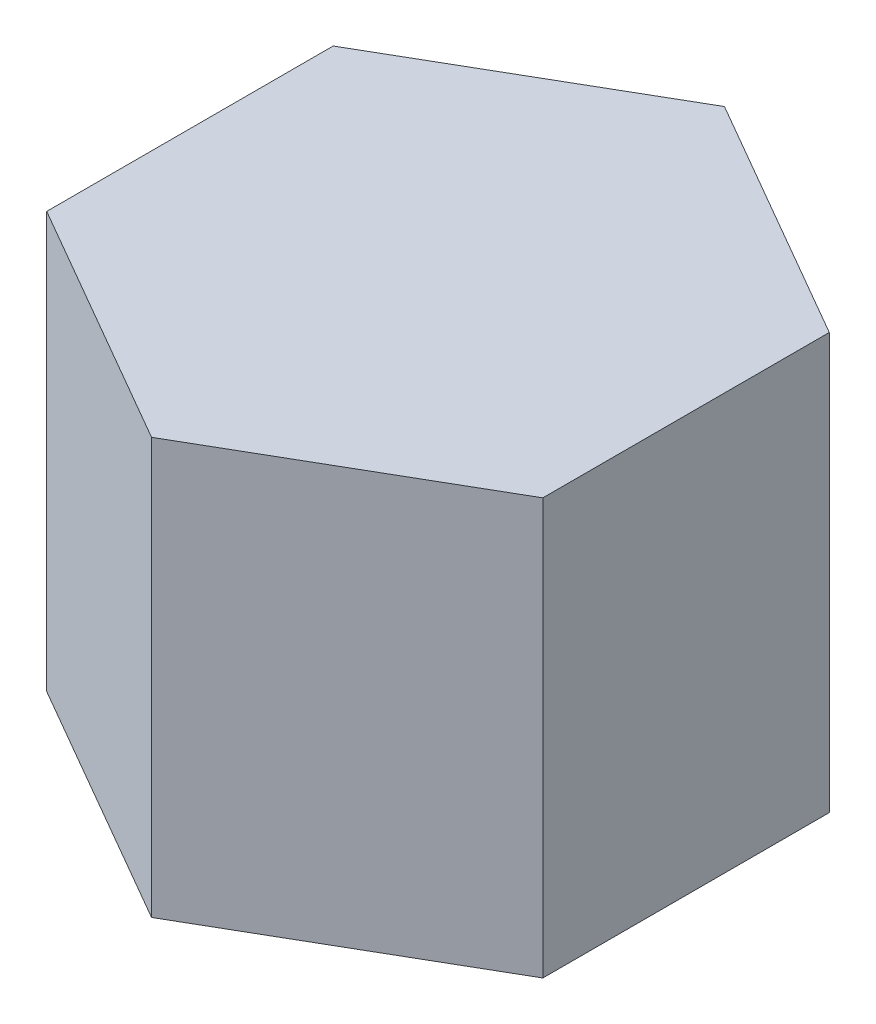
ISO-10303-21;
HEADER;
FILE_DESCRIPTION(('STEP AP214'),'2;1');
FILE_NAME('part.step','',(''),(''),'','','');
FILE_SCHEMA(('AUTOMOTIVE_DESIGN { 1 0 10303 214 1 1 1 1 }'));
ENDSEC;
DATA;
#1=APPLICATION_CONTEXT('core data for automotive mechanical design processes');
#2=APPLICATION_PROTOCOL_DEFINITION('international standard','automotive_design',2000,#1);
#3=PRODUCT_CONTEXT('',#1,'mechanical');
#4=PRODUCT('Part','Part','',(#3));
#5=PRODUCT_RELATED_PRODUCT_CATEGORY('part','',(#4));
#6=PRODUCT_DEFINITION_FORMATION('','',#4);
#7=PRODUCT_DEFINITION_CONTEXT('part definition',#1,'design');
#8=PRODUCT_DEFINITION('design','',#6,#7);
#9=PRODUCT_DEFINITION_SHAPE('','',#8);
#10=(LENGTH_UNIT() NAMED_UNIT(*) SI_UNIT(.MILLI.,.METRE.));
#11=(NAMED_UNIT(*) PLANE_ANGLE_UNIT() SI_UNIT($,.RADIAN.));
#12=(NAMED_UNIT(*) SI_UNIT($,.STERADIAN.) SOLID_ANGLE_UNIT());
#13=UNCERTAINTY_MEASURE_WITH_UNIT(LENGTH_MEASURE(1.E-05),#10,'distance_accuracy_value','');
#14=(GEOMETRIC_REPRESENTATION_CONTEXT(3) GLOBAL_UNCERTAINTY_ASSIGNED_CONTEXT((#13)) GLOBAL_UNIT_ASSIGNED_CONTEXT((#10,
#11,#12)) REPRESENTATION_CONTEXT('',''));
#15=CARTESIAN_POINT('',(0.,0.,0.));
#16=DIRECTION('',(0.,0.,1.));
#17=DIRECTION('',(1.,0.,0.));
#18=AXIS2_PLACEMENT_3D('',#15,#16,#17);
#19=CARTESIAN_POINT('',(205.142660308706,-148.537700895744,290.64094581671));
#20=DIRECTION('',(-0.499999999999909,0.,-0.866025403784491));
#21=DIRECTION('',(-0.866025403784491,0.,0.499999999999909));
#22=AXIS2_PLACEMENT_3D('',#19,#20,#21);
#23=PLANE('',#22);
#24=CARTESIAN_POINT('',(204.839551417382,-149.045793579175,290.81594581671));
#25=DIRECTION('',(0.866025403784491,0.,-0.499999999999909));
#26=VECTOR('',#25,1.);
#27=LINE('',#24,#26);
#28=CARTESIAN_POINT('',(204.839551417382,-149.045793579175,290.81594581671));
#29=VERTEX_POINT('',#28);
#30=CARTESIAN_POINT('',(205.142660308706,-149.045793579175,290.64094581671));
#31=VERTEX_POINT('',#30);
#32=EDGE_CURVE('E170',#29,#31,#27,.T.);
#33=ORIENTED_EDGE('',*,*,#32,.T.);
#34=CARTESIAN_POINT('',(205.142660308706,-148.537700895744,290.64094581671));
#35=DIRECTION('',(0.,-1.,0.));
#36=VECTOR('',#35,1.);
#37=LINE('',#34,#36);
#38=CARTESIAN_POINT('',(205.142660308706,-148.537700895744,290.64094581671));
#39=VERTEX_POINT('',#38);
#40=EDGE_CURVE('E35',#39,#31,#37,.T.);
#41=ORIENTED_EDGE('',*,*,#40,.F.);
#42=CARTESIAN_POINT('',(204.839551417382,-148.537700895744,290.81594581671));
#43=DIRECTION('',(0.866025403784491,0.,-0.499999999999909));
#44=VECTOR('',#43,1.);
#45=LINE('',#42,#44);
#46=CARTESIAN_POINT('',(204.839551417382,-148.537700895744,290.81594581671));
#47=VERTEX_POINT('',#46);
#48=EDGE_CURVE('E159',#47,#39,#45,.T.);
#49=ORIENTED_EDGE('',*,*,#48,.F.);
#50=CARTESIAN_POINT('',(204.839551417382,-148.537700895744,290.81594581671));
#51=DIRECTION('',(0.,-1.,0.));
#52=VECTOR('',#51,1.);
#53=LINE('',#50,#52);
#54=EDGE_CURVE('E10',#47,#29,#53,.T.);
#55=ORIENTED_EDGE('',*,*,#54,.T.);
#56=EDGE_LOOP('',(#33,#41,#49,#55));
#57=FACE_BOUND('',#56,.T.);
#58=ADVANCED_FACE('F16',(#57),#23,.F.);
#59=CARTESIAN_POINT('',(204.839551417382,-148.537700895744,290.81594581671));
#60=DIRECTION('',(0.500000000000062,0.,-0.866025403784403));
#61=DIRECTION('',(-0.866025403784403,0.,-0.500000000000062));
#62=AXIS2_PLACEMENT_3D('',#59,#60,#61);
#63=PLANE('',#62);
#64=CARTESIAN_POINT('',(204.536442526057,-149.045793579175,290.64094581671));
#65=DIRECTION('',(0.866025403784403,0.,0.500000000000062));
#66=VECTOR('',#65,1.);
#67=LINE('',#64,#66);
#68=CARTESIAN_POINT('',(204.536442526057,-149.045793579175,290.64094581671));
#69=VERTEX_POINT('',#68);
#70=EDGE_CURVE('E167',#69,#29,#67,.T.);
#71=ORIENTED_EDGE('',*,*,#70,.T.);
#72=ORIENTED_EDGE('',*,*,#54,.F.);
#73=CARTESIAN_POINT('',(204.536442526057,-148.537700895744,290.64094581671));
#74=DIRECTION('',(0.866025403784403,0.,0.500000000000062));
#75=VECTOR('',#74,1.);
#76=LINE('',#73,#75);
#77=CARTESIAN_POINT('',(204.536442526057,-148.537700895744,290.64094581671));
#78=VERTEX_POINT('',#77);
#79=EDGE_CURVE('E156',#78,#47,#76,.T.);
#80=ORIENTED_EDGE('',*,*,#79,.F.);
#81=CARTESIAN_POINT('',(204.536442526057,-148.537700895744,290.64094581671));
#82=DIRECTION('',(0.,-1.,0.));
#83=VECTOR('',#82,1.);
#84=LINE('',#81,#83);
#85=EDGE_CURVE('E27',#78,#69,#84,.T.);
#86=ORIENTED_EDGE('',*,*,#85,.T.);
#87=EDGE_LOOP('',(#71,#72,#80,#86));
#88=FACE_BOUND('',#87,.T.);
#89=ADVANCED_FACE('F189',(#88),#63,.F.);
#90=CARTESIAN_POINT('',(204.536442526057,-148.537700895744,290.831971220494));
#91=DIRECTION('',(1.,0.,0.));
#92=DIRECTION('',(0.,1.,0.));
#93=AXIS2_PLACEMENT_3D('',#90,#91,#92);
#94=PLANE('',#93);
#95=CARTESIAN_POINT('',(204.536442526057,-149.045793579175,290.29094581671));
#96=DIRECTION('',(0.,0.,1.));
#97=VECTOR('',#96,1.);
#98=LINE('',#95,#97);
#99=CARTESIAN_POINT('',(204.536442526057,-149.045793579175,290.29094581671));
#100=VERTEX_POINT('',#99);
#101=EDGE_CURVE('E163',#100,#69,#98,.T.);
#102=ORIENTED_EDGE('',*,*,#101,.T.);
#103=ORIENTED_EDGE('',*,*,#85,.F.);
#104=CARTESIAN_POINT('',(204.536442526057,-148.537700895744,290.29094581671));
#105=DIRECTION('',(0.,0.,1.));
#106=VECTOR('',#105,1.);
#107=LINE('',#104,#106);
#108=CARTESIAN_POINT('',(204.536442526057,-148.537700895744,290.29094581671));
#109=VERTEX_POINT('',#108);
#110=EDGE_CURVE('E106',#109,#78,#107,.T.);
#111=ORIENTED_EDGE('',*,*,#110,.F.);
#112=CARTESIAN_POINT('',(204.536442526057,-148.537700895744,290.29094581671));
#113=DIRECTION('',(0.,-1.,0.));
#114=VECTOR('',#113,1.);
#115=LINE('',#112,#114);
#116=EDGE_CURVE('E94',#109,#100,#115,.T.);
#117=ORIENTED_EDGE('',*,*,#116,.T.);
#118=EDGE_LOOP('',(#102,#103,#111,#117));
#119=FACE_BOUND('',#118,.T.);
#120=ADVANCED_FACE('F198',(#119),#94,.F.);
#121=CARTESIAN_POINT('',(204.536442526057,-148.537700895744,290.29094581671));
#122=DIRECTION('',(0.499999999999943,0.,0.866025403784472));
#123=DIRECTION('',(0.866025403784472,0.,-0.499999999999943));
#124=AXIS2_PLACEMENT_3D('',#121,#122,#123);
#125=PLANE('',#124);
#126=CARTESIAN_POINT('',(204.839551417382,-149.045793579175,290.11594581671));
#127=DIRECTION('',(-0.866025403784471,0.,0.499999999999943));
#128=VECTOR('',#127,1.);
#129=LINE('',#126,#128);
#130=CARTESIAN_POINT('',(204.839551417382,-149.045793579175,290.11594581671));
#131=VERTEX_POINT('',#130);
#132=EDGE_CURVE('E162',#131,#100,#129,.T.);
#133=ORIENTED_EDGE('',*,*,#132,.T.);
#134=ORIENTED_EDGE('',*,*,#116,.F.);
#135=CARTESIAN_POINT('',(204.839551417382,-148.537700895744,290.11594581671));
#136=DIRECTION('',(-0.866025403784471,0.,0.499999999999943));
#137=VECTOR('',#136,1.);
#138=LINE('',#135,#137);
#139=CARTESIAN_POINT('',(204.839551417382,-148.537700895744,290.11594581671));
#140=VERTEX_POINT('',#139);
#141=EDGE_CURVE('E98',#140,#109,#138,.T.);
#142=ORIENTED_EDGE('',*,*,#141,.F.);
#143=CARTESIAN_POINT('',(204.839551417382,-148.537700895744,290.11594581671));
#144=DIRECTION('',(0.,-1.,0.));
#145=VECTOR('',#144,1.);
#146=LINE('',#143,#145);
#147=EDGE_CURVE('E79',#140,#131,#146,.T.);
#148=ORIENTED_EDGE('',*,*,#147,.T.);
#149=EDGE_LOOP('',(#133,#134,#142,#148));
#150=FACE_BOUND('',#149,.T.);
#151=ADVANCED_FACE('F100',(#150),#125,.F.);
#152=CARTESIAN_POINT('',(204.839551417381,-148.537700895744,290.11594581671));
#153=DIRECTION('',(-0.500000000000062,0.,0.866025403784403));
#154=DIRECTION('',(0.866025403784403,0.,0.500000000000062));
#155=AXIS2_PLACEMENT_3D('',#152,#153,#154);
#156=PLANE('',#155);
#157=CARTESIAN_POINT('',(205.142660308706,-149.045793579175,290.29094581671));
#158=DIRECTION('',(-0.866025403784403,0.,-0.500000000000062));
#159=VECTOR('',#158,1.);
#160=LINE('',#157,#159);
#161=CARTESIAN_POINT('',(205.142660308706,-149.045793579175,290.29094581671));
#162=VERTEX_POINT('',#161);
#163=EDGE_CURVE('E88',#162,#131,#160,.T.);
#164=ORIENTED_EDGE('',*,*,#163,.T.);
#165=ORIENTED_EDGE('',*,*,#147,.F.);
#166=CARTESIAN_POINT('',(205.142660308706,-148.537700895744,290.29094581671));
#167=DIRECTION('',(-0.866025403784403,0.,-0.500000000000062));
#168=VECTOR('',#167,1.);
#169=LINE('',#166,#168);
#170=CARTESIAN_POINT('',(205.142660308706,-148.537700895744,290.29094581671));
#171=VERTEX_POINT('',#170);
#172=EDGE_CURVE('E84',#171,#140,#169,.T.);
#173=ORIENTED_EDGE('',*,*,#172,.F.);
#174=CARTESIAN_POINT('',(205.142660308706,-148.537700895744,290.29094581671));
#175=DIRECTION('',(0.,-1.,0.));
#176=VECTOR('',#175,1.);
#177=LINE('',#174,#176);
#178=EDGE_CURVE('E58',#171,#162,#177,.T.);
#179=ORIENTED_EDGE('',*,*,#178,.T.);
#180=EDGE_LOOP('',(#164,#165,#173,#179));
#181=FACE_BOUND('',#180,.T.);
#182=ADVANCED_FACE('F82',(#181),#156,.F.);
#183=CARTESIAN_POINT('',(205.142660308706,-148.537700895744,290.831971220494));
#184=DIRECTION('',(-1.,0.,0.));
#185=DIRECTION('',(0.,-1.,0.));
#186=AXIS2_PLACEMENT_3D('',#183,#184,#185);
#187=PLANE('',#186);
#188=CARTESIAN_POINT('',(205.142660308706,-149.045793579175,290.64094581671));
#189=DIRECTION('',(0.,0.,-1.));
#190=VECTOR('',#189,1.);
#191=LINE('',#188,#190);
#192=EDGE_CURVE('E160',#31,#162,#191,.T.);
#193=ORIENTED_EDGE('',*,*,#192,.T.);
#194=ORIENTED_EDGE('',*,*,#178,.F.);
#195=CARTESIAN_POINT('',(205.142660308706,-148.537700895744,290.64094581671));
#196=DIRECTION('',(0.,0.,-1.));
#197=VECTOR('',#196,1.);
#198=LINE('',#195,#197);
#199=EDGE_CURVE('E112',#39,#171,#198,.T.);
#200=ORIENTED_EDGE('',*,*,#199,.F.);
#201=ORIENTED_EDGE('',*,*,#40,.T.);
#202=EDGE_LOOP('',(#193,#194,#200,#201));
#203=FACE_BOUND('',#202,.T.);
#204=ADVANCED_FACE('F131',(#203),#187,.F.);
#205=CARTESIAN_POINT('',(206.339551417382,-148.537700895744,290.831971220494));
#206=DIRECTION('',(0.,-1.,0.));
#207=DIRECTION('',(1.,0.,0.));
#208=AXIS2_PLACEMENT_3D('',#205,#206,#207);
#209=PLANE('',#208);
#210=ORIENTED_EDGE('',*,*,#48,.T.);
#211=ORIENTED_EDGE('',*,*,#199,.T.);
#212=ORIENTED_EDGE('',*,*,#172,.T.);
#213=ORIENTED_EDGE('',*,*,#141,.T.);
#214=ORIENTED_EDGE('',*,*,#110,.T.);
#215=ORIENTED_EDGE('',*,*,#79,.T.);
#216=EDGE_LOOP('',(#210,#211,#212,#213,#214,#215));
#217=FACE_BOUND('',#216,.T.);
#218=ADVANCED_FACE('F111',(#217),#209,.F.);
#219=CARTESIAN_POINT('',(206.339551417382,-149.045793579175,290.831971220494));
#220=DIRECTION('',(0.,-1.,0.));
#221=DIRECTION('',(1.,0.,0.));
#222=AXIS2_PLACEMENT_3D('',#219,#220,#221);
#223=PLANE('',#222);
#224=ORIENTED_EDGE('',*,*,#32,.F.);
#225=ORIENTED_EDGE('',*,*,#70,.F.);
#226=ORIENTED_EDGE('',*,*,#101,.F.);
#227=ORIENTED_EDGE('',*,*,#132,.F.);
#228=ORIENTED_EDGE('',*,*,#163,.F.);
#229=ORIENTED_EDGE('',*,*,#192,.F.);
#230=EDGE_LOOP('',(#224,#225,#226,#227,#228,#229));
#231=FACE_BOUND('',#230,.T.);
#232=ADVANCED_FACE('F130',(#231),#223,.T.);
#233=CLOSED_SHELL('',(#58,#89,#120,#151,#182,#204,#218,#232));
#234=MANIFOLD_SOLID_BREP('B1',#233);
#235=ADVANCED_BREP_SHAPE_REPRESENTATION('',(#18,#234),#14);
#236=SHAPE_DEFINITION_REPRESENTATION(#9,#235);
ENDSEC;
END-ISO-10303-21;
